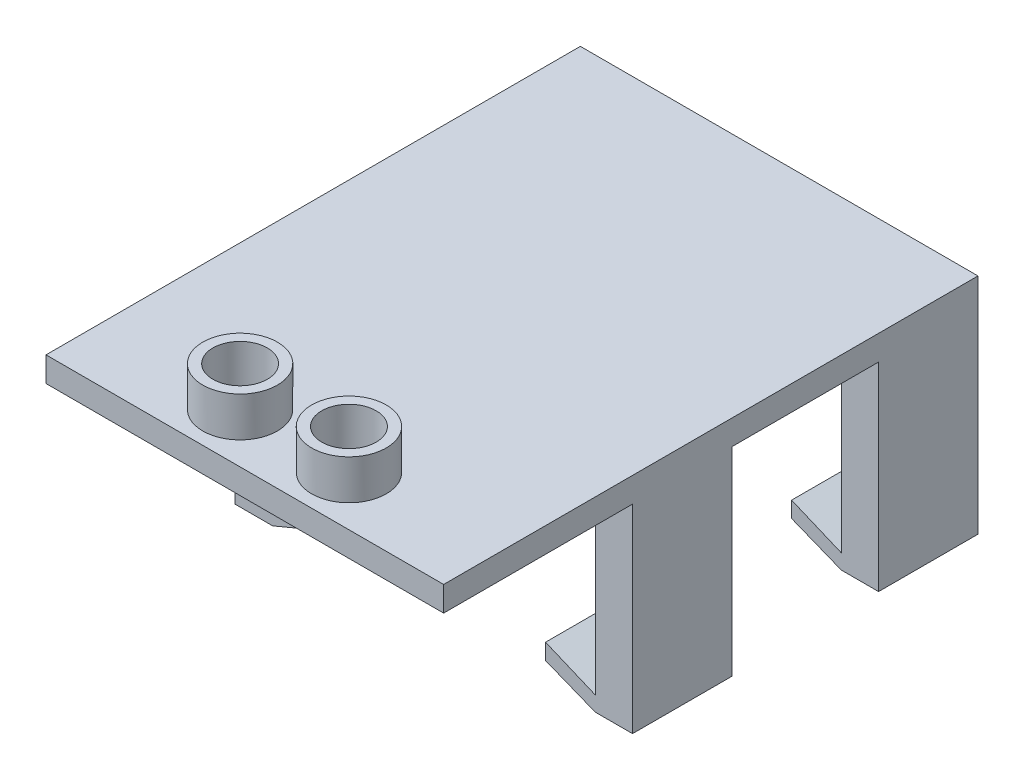
ISO-10303-21;
HEADER;
FILE_DESCRIPTION(('STEP AP214'),'2;1');
FILE_NAME('part.step','',(''),(''),'','','');
FILE_SCHEMA(('AUTOMOTIVE_DESIGN { 1 0 10303 214 1 1 1 1 }'));
ENDSEC;
DATA;
#1=APPLICATION_CONTEXT('core data for automotive mechanical design processes');
#2=APPLICATION_PROTOCOL_DEFINITION('international standard','automotive_design',2000,#1);
#3=PRODUCT_CONTEXT('',#1,'mechanical');
#4=PRODUCT('Part','Part','',(#3));
#5=PRODUCT_RELATED_PRODUCT_CATEGORY('part','',(#4));
#6=PRODUCT_DEFINITION_FORMATION('','',#4);
#7=PRODUCT_DEFINITION_CONTEXT('part definition',#1,'design');
#8=PRODUCT_DEFINITION('design','',#6,#7);
#9=PRODUCT_DEFINITION_SHAPE('','',#8);
#10=(LENGTH_UNIT() NAMED_UNIT(*) SI_UNIT(.MILLI.,.METRE.));
#11=(NAMED_UNIT(*) PLANE_ANGLE_UNIT() SI_UNIT($,.RADIAN.));
#12=(NAMED_UNIT(*) SI_UNIT($,.STERADIAN.) SOLID_ANGLE_UNIT());
#13=UNCERTAINTY_MEASURE_WITH_UNIT(LENGTH_MEASURE(1.E-05),#10,'distance_accuracy_value','');
#14=(GEOMETRIC_REPRESENTATION_CONTEXT(3) GLOBAL_UNCERTAINTY_ASSIGNED_CONTEXT((#13)) GLOBAL_UNIT_ASSIGNED_CONTEXT((#10,
#11,#12)) REPRESENTATION_CONTEXT('',''));
#15=CARTESIAN_POINT('',(0.,0.,0.));
#16=DIRECTION('',(0.,0.,1.));
#17=DIRECTION('',(1.,0.,0.));
#18=AXIS2_PLACEMENT_3D('',#15,#16,#17);
#19=CARTESIAN_POINT('',(0.,-20.32,0.));
#20=DIRECTION('',(0.,-1.,0.));
#21=DIRECTION('',(0.,0.,-1.));
#22=AXIS2_PLACEMENT_3D('',#19,#20,#21);
#23=PLANE('',#22);
#24=DIRECTION('',(1.,0.,0.));
#25=VECTOR('',#24,1.);
#26=CARTESIAN_POINT('',(-11.5172519083969,-20.32,-12.4409837837973));
#27=LINE('',#26,#25);
#28=CARTESIAN_POINT('',(-11.5172519083969,-20.32,-12.4409837837973));
#29=VERTEX_POINT('',#28);
#30=CARTESIAN_POINT('',(-7.66074574714831,-20.32,-12.4409837837973));
#31=VERTEX_POINT('',#30);
#32=EDGE_CURVE('E249',#29,#31,#27,.T.);
#33=ORIENTED_EDGE('',*,*,#32,.T.);
#34=DIRECTION('',(0.,0.,1.));
#35=VECTOR('',#34,1.);
#36=CARTESIAN_POINT('',(-7.66074574714831,-20.32,-12.4409837837973));
#37=LINE('',#36,#35);
#38=CARTESIAN_POINT('',(-7.66074574714831,-20.32,-2.28098378379731));
#39=VERTEX_POINT('',#38);
#40=EDGE_CURVE('E232',#31,#39,#37,.T.);
#41=ORIENTED_EDGE('',*,*,#40,.T.);
#42=DIRECTION('',(1.,0.,0.));
#43=VECTOR('',#42,1.);
#44=CARTESIAN_POINT('',(-11.517251908397,-20.32,-2.28098378379731));
#45=LINE('',#44,#43);
#46=CARTESIAN_POINT('',(-11.517251908397,-20.32,-2.28098378379731));
#47=VERTEX_POINT('',#46);
#48=EDGE_CURVE('E447',#47,#39,#45,.T.);
#49=ORIENTED_EDGE('',*,*,#48,.F.);
#50=DIRECTION('',(0.,0.,-1.));
#51=VECTOR('',#50,1.);
#52=CARTESIAN_POINT('',(-11.5172519083969,-20.32,27.9450162162027));
#53=LINE('',#52,#51);
#54=EDGE_CURVE('E255',#47,#29,#53,.T.);
#55=ORIENTED_EDGE('',*,*,#54,.T.);
#56=EDGE_LOOP('',(#33,#41,#49,#55));
#57=FACE_BOUND('',#56,.T.);
#58=ADVANCED_FACE('F37',(#57),#23,.T.);
#59=CARTESIAN_POINT('',(0.,-20.32,0.));
#60=DIRECTION('',(0.,1.,0.));
#61=DIRECTION('',(0.,0.,1.));
#62=AXIS2_PLACEMENT_3D('',#59,#60,#61);
#63=PLANE('',#62);
#64=DIRECTION('',(0.,0.,1.));
#65=VECTOR('',#64,1.);
#66=CARTESIAN_POINT('',(25.3127480916031,-20.32,-12.4409837837973));
#67=LINE('',#66,#65);
#68=CARTESIAN_POINT('',(25.3127480916031,-20.32,-12.4409837837973));
#69=VERTEX_POINT('',#68);
#70=CARTESIAN_POINT('',(25.3127480916031,-20.32,-2.28098378379732));
#71=VERTEX_POINT('',#70);
#72=EDGE_CURVE('E52',#69,#71,#67,.T.);
#73=ORIENTED_EDGE('',*,*,#72,.F.);
#74=DIRECTION('',(1.,0.,0.));
#75=VECTOR('',#74,1.);
#76=CARTESIAN_POINT('',(29.1227480916031,-20.32,-12.4409837837973));
#77=LINE('',#76,#75);
#78=CARTESIAN_POINT('',(29.1227480916031,-20.32,-12.4409837837973));
#79=VERTEX_POINT('',#78);
#80=EDGE_CURVE('E348',#69,#79,#77,.T.);
#81=ORIENTED_EDGE('',*,*,#80,.T.);
#82=DIRECTION('',(0.,0.,1.));
#83=VECTOR('',#82,1.);
#84=CARTESIAN_POINT('',(29.1227480916031,-20.32,27.9450162162027));
#85=LINE('',#84,#83);
#86=CARTESIAN_POINT('',(29.1227480916031,-20.32,-2.28098378379732));
#87=VERTEX_POINT('',#86);
#88=EDGE_CURVE('E339',#79,#87,#85,.T.);
#89=ORIENTED_EDGE('',*,*,#88,.T.);
#90=EDGE_CURVE('E457',#71,#87,#45,.T.);
#91=ORIENTED_EDGE('',*,*,#90,.F.);
#92=EDGE_LOOP('',(#73,#81,#89,#91));
#93=FACE_BOUND('',#92,.T.);
#94=ADVANCED_FACE('F517',(#93),#63,.F.);
#95=CARTESIAN_POINT('',(20.2327480916031,0.,0.));
#96=DIRECTION('',(-1.,0.,0.));
#97=DIRECTION('',(0.,0.,1.));
#98=AXIS2_PLACEMENT_3D('',#95,#96,#97);
#99=PLANE('',#98);
#100=DIRECTION('',(0.,-1.,0.));
#101=VECTOR('',#100,1.);
#102=CARTESIAN_POINT('',(20.2327480916031,-18.796,-12.4409837837973));
#103=LINE('',#102,#101);
#104=CARTESIAN_POINT('',(20.2327480916031,-16.6688197799885,-12.4409837837973));
#105=VERTEX_POINT('',#104);
#106=CARTESIAN_POINT('',(20.2327480916031,-18.2946026362876,-12.4409837837973));
#107=VERTEX_POINT('',#106);
#108=EDGE_CURVE('E361',#105,#107,#103,.T.);
#109=ORIENTED_EDGE('',*,*,#108,.T.);
#110=DIRECTION('',(0.,0.,1.));
#111=VECTOR('',#110,1.);
#112=CARTESIAN_POINT('',(20.2327480916031,-18.2946026362876,-12.4409837837973));
#113=LINE('',#112,#111);
#114=CARTESIAN_POINT('',(20.2327480916031,-18.2946026362876,-2.28098378379732));
#115=VERTEX_POINT('',#114);
#116=EDGE_CURVE('E476',#107,#115,#113,.T.);
#117=ORIENTED_EDGE('',*,*,#116,.T.);
#118=DIRECTION('',(0.,-1.,0.));
#119=VECTOR('',#118,1.);
#120=CARTESIAN_POINT('',(20.2327480916031,0.,-2.28098378379732));
#121=LINE('',#120,#119);
#122=CARTESIAN_POINT('',(20.2327480916031,-16.6688197799885,-2.28098378379732));
#123=VERTEX_POINT('',#122);
#124=EDGE_CURVE('E429',#123,#115,#121,.T.);
#125=ORIENTED_EDGE('',*,*,#124,.F.);
#126=DIRECTION('',(0.,0.,1.));
#127=VECTOR('',#126,1.);
#128=CARTESIAN_POINT('',(20.2327480916031,-16.6688197799885,-17.9796028196735));
#129=LINE('',#128,#127);
#130=EDGE_CURVE('E410',#105,#123,#129,.T.);
#131=ORIENTED_EDGE('',*,*,#130,.F.);
#132=EDGE_LOOP('',(#109,#117,#125,#131));
#133=FACE_BOUND('',#132,.T.);
#134=ADVANCED_FACE('F523',(#133),#99,.T.);
#135=CARTESIAN_POINT('',(-2.59340745083259,-16.6688197799885,-17.9796028196735));
#136=DIRECTION('',(0.999873452344455,-0.0159084661982284,0.));
#137=DIRECTION('',(0.0159084661982284,0.999873452344455,0.));
#138=AXIS2_PLACEMENT_3D('',#135,#136,#137);
#139=PLANE('',#138);
#140=DIRECTION('',(0.0159084661982284,0.999873452344455,0.));
#141=VECTOR('',#140,1.);
#142=CARTESIAN_POINT('',(-2.59340745083259,-16.6688197799885,-2.28098378379732));
#143=LINE('',#142,#141);
#144=CARTESIAN_POINT('',(-2.61803166417197,-18.2164923774667,-2.28098378379732));
#145=VERTEX_POINT('',#144);
#146=CARTESIAN_POINT('',(-2.59340745083259,-16.6688197799885,-2.28098378379731));
#147=VERTEX_POINT('',#146);
#148=EDGE_CURVE('E417',#145,#147,#143,.T.);
#149=ORIENTED_EDGE('',*,*,#148,.F.);
#150=DIRECTION('',(0.,0.,1.));
#151=VECTOR('',#150,1.);
#152=CARTESIAN_POINT('',(-2.61803166417197,-18.2164923774667,-12.4409837837973));
#153=LINE('',#152,#151);
#154=CARTESIAN_POINT('',(-2.61803166417197,-18.2164923774667,-12.4409837837973));
#155=VERTEX_POINT('',#154);
#156=EDGE_CURVE('E60',#155,#145,#153,.T.);
#157=ORIENTED_EDGE('',*,*,#156,.F.);
#158=DIRECTION('',(-0.0159084661982284,-0.999873452344455,0.));
#159=VECTOR('',#158,1.);
#160=CARTESIAN_POINT('',(-2.59340745083259,-16.6688197799885,-12.4409837837973));
#161=LINE('',#160,#159);
#162=CARTESIAN_POINT('',(-2.59340745083259,-16.6688197799885,-12.4409837837973));
#163=VERTEX_POINT('',#162);
#164=EDGE_CURVE('E251',#163,#155,#161,.T.);
#165=ORIENTED_EDGE('',*,*,#164,.F.);
#166=DIRECTION('',(0.,0.,1.));
#167=VECTOR('',#166,1.);
#168=CARTESIAN_POINT('',(-2.59340745083259,-16.6688197799885,-17.9796028196735));
#169=LINE('',#168,#167);
#170=EDGE_CURVE('E397',#163,#147,#169,.T.);
#171=ORIENTED_EDGE('',*,*,#170,.T.);
#172=EDGE_LOOP('',(#149,#157,#165,#171));
#173=FACE_BOUND('',#172,.T.);
#174=ADVANCED_FACE('F528',(#173),#139,.T.);
#175=DIRECTION('',(1.,0.,0.));
#176=VECTOR('',#175,1.);
#177=CARTESIAN_POINT('',(-11.517251908397,-20.32,12.7050162162027));
#178=LINE('',#177,#176);
#179=CARTESIAN_POINT('',(-11.517251908397,-20.32,12.7050162162027));
#180=VERTEX_POINT('',#179);
#181=CARTESIAN_POINT('',(-7.66074574714831,-20.32,12.7050162162027));
#182=VERTEX_POINT('',#181);
#183=EDGE_CURVE('E454',#180,#182,#178,.T.);
#184=ORIENTED_EDGE('',*,*,#183,.T.);
#185=CARTESIAN_POINT('',(-7.66074574714831,-20.32,22.8650162162027));
#186=VERTEX_POINT('',#185);
#187=EDGE_CURVE('E242',#182,#186,#37,.T.);
#188=ORIENTED_EDGE('',*,*,#187,.T.);
#189=DIRECTION('',(1.,0.,0.));
#190=VECTOR('',#189,1.);
#191=CARTESIAN_POINT('',(-11.5172519083969,-20.32,22.8650162162027));
#192=LINE('',#191,#190);
#193=CARTESIAN_POINT('',(-11.5172519083969,-20.32,22.8650162162027));
#194=VERTEX_POINT('',#193);
#195=EDGE_CURVE('E375',#194,#186,#192,.T.);
#196=ORIENTED_EDGE('',*,*,#195,.F.);
#197=EDGE_CURVE('E258',#194,#180,#53,.T.);
#198=ORIENTED_EDGE('',*,*,#197,.T.);
#199=EDGE_LOOP('',(#184,#188,#196,#198));
#200=FACE_BOUND('',#199,.T.);
#201=ADVANCED_FACE('F519',(#200),#23,.T.);
#202=CARTESIAN_POINT('',(25.3127480916031,-20.32,12.7050162162027));
#203=VERTEX_POINT('',#202);
#204=CARTESIAN_POINT('',(25.3127480916031,-20.32,22.8650162162027));
#205=VERTEX_POINT('',#204);
#206=EDGE_CURVE('E479',#203,#205,#67,.T.);
#207=ORIENTED_EDGE('',*,*,#206,.F.);
#208=CARTESIAN_POINT('',(29.1227480916031,-20.32,12.7050162162027));
#209=VERTEX_POINT('',#208);
#210=EDGE_CURVE('E453',#203,#209,#178,.T.);
#211=ORIENTED_EDGE('',*,*,#210,.T.);
#212=CARTESIAN_POINT('',(29.1227480916031,-20.32,22.8650162162027));
#213=VERTEX_POINT('',#212);
#214=EDGE_CURVE('E344',#209,#213,#85,.T.);
#215=ORIENTED_EDGE('',*,*,#214,.T.);
#216=EDGE_CURVE('E378',#205,#213,#192,.T.);
#217=ORIENTED_EDGE('',*,*,#216,.F.);
#218=EDGE_LOOP('',(#207,#211,#215,#217));
#219=FACE_BOUND('',#218,.T.);
#220=ADVANCED_FACE('F525',(#219),#63,.F.);
#221=DIRECTION('',(0.,1.,0.));
#222=VECTOR('',#221,1.);
#223=CARTESIAN_POINT('',(20.2327480916031,0.,12.7050162162027));
#224=LINE('',#223,#222);
#225=CARTESIAN_POINT('',(20.2327480916031,-18.2946026362876,12.7050162162027));
#226=VERTEX_POINT('',#225);
#227=CARTESIAN_POINT('',(20.2327480916031,-16.6688197799885,12.7050162162027));
#228=VERTEX_POINT('',#227);
#229=EDGE_CURVE('E445',#226,#228,#224,.T.);
#230=ORIENTED_EDGE('',*,*,#229,.F.);
#231=CARTESIAN_POINT('',(20.2327480916031,-18.2946026362876,22.8650162162027));
#232=VERTEX_POINT('',#231);
#233=EDGE_CURVE('E480',#226,#232,#113,.T.);
#234=ORIENTED_EDGE('',*,*,#233,.T.);
#235=DIRECTION('',(0.,1.,0.));
#236=VECTOR('',#235,1.);
#237=CARTESIAN_POINT('',(20.2327480916031,0.,22.8650162162027));
#238=LINE('',#237,#236);
#239=CARTESIAN_POINT('',(20.2327480916031,-16.6688197799885,22.8650162162027));
#240=VERTEX_POINT('',#239);
#241=EDGE_CURVE('E300',#232,#240,#238,.T.);
#242=ORIENTED_EDGE('',*,*,#241,.T.);
#243=EDGE_CURVE('E413',#228,#240,#129,.T.);
#244=ORIENTED_EDGE('',*,*,#243,.F.);
#245=EDGE_LOOP('',(#230,#234,#242,#244));
#246=FACE_BOUND('',#245,.T.);
#247=ADVANCED_FACE('F534',(#246),#99,.T.);
#248=CARTESIAN_POINT('',(-11.5172519083969,2.54,-12.4409837837973));
#249=DIRECTION('',(0.,0.,1.));
#250=DIRECTION('',(1.,0.,0.));
#251=AXIS2_PLACEMENT_3D('',#248,#249,#250);
#252=PLANE('',#251);
#253=DIRECTION('',(0.922922412237394,0.384986001031089,0.));
#254=VECTOR('',#253,1.);
#255=CARTESIAN_POINT('',(6.08451261866922,-14.5863305373994,-12.4409837837973));
#256=LINE('',#255,#254);
#257=EDGE_CURVE('E235',#31,#155,#256,.T.);
#258=ORIENTED_EDGE('',*,*,#257,.F.);
#259=ORIENTED_EDGE('',*,*,#32,.F.);
#260=DIRECTION('',(0.,-1.,0.));
#261=VECTOR('',#260,1.);
#262=CARTESIAN_POINT('',(-11.5172519083969,2.54,-12.4409837837973));
#263=LINE('',#262,#261);
#264=CARTESIAN_POINT('',(-11.5172519083969,2.54,-12.4409837837973));
#265=VERTEX_POINT('',#264);
#266=EDGE_CURVE('E283',#265,#29,#263,.T.);
#267=ORIENTED_EDGE('',*,*,#266,.F.);
#268=DIRECTION('',(-1.,0.,0.));
#269=VECTOR('',#268,1.);
#270=CARTESIAN_POINT('',(-11.5172519083969,2.54,-12.4409837837973));
#271=LINE('',#270,#269);
#272=CARTESIAN_POINT('',(29.1227480916031,2.54,-12.4409837837973));
#273=VERTEX_POINT('',#272);
#274=EDGE_CURVE('E281',#273,#265,#271,.T.);
#275=ORIENTED_EDGE('',*,*,#274,.F.);
#276=DIRECTION('',(0.,-1.,0.));
#277=VECTOR('',#276,1.);
#278=CARTESIAN_POINT('',(29.1227480916031,2.54,-12.4409837837973));
#279=LINE('',#278,#277);
#280=EDGE_CURVE('E291',#273,#79,#279,.T.);
#281=ORIENTED_EDGE('',*,*,#280,.T.);
#282=ORIENTED_EDGE('',*,*,#80,.F.);
#283=DIRECTION('',(0.928892421611158,-0.370349657855058,0.));
#284=VECTOR('',#283,1.);
#285=CARTESIAN_POINT('',(-3.51851670614279,-8.82496698546269,-12.4409837837973));
#286=LINE('',#285,#284);
#287=EDGE_CURVE('E485',#107,#69,#286,.T.);
#288=ORIENTED_EDGE('',*,*,#287,.F.);
#289=ORIENTED_EDGE('',*,*,#108,.F.);
#290=DIRECTION('',(0.922397741391246,-0.386241383950928,0.));
#291=VECTOR('',#290,1.);
#292=CARTESIAN_POINT('',(20.2327480916031,-16.6688197799885,-12.4409837837973));
#293=LINE('',#292,#291);
#294=CARTESIAN_POINT('',(25.3127480916031,-18.796,-12.4409837837973));
#295=VERTEX_POINT('',#294);
#296=EDGE_CURVE('E414',#105,#295,#293,.T.);
#297=ORIENTED_EDGE('',*,*,#296,.T.);
#298=DIRECTION('',(0.,1.,0.));
#299=VECTOR('',#298,1.);
#300=CARTESIAN_POINT('',(25.3127480916031,-20.32,-12.4409837837973));
#301=LINE('',#300,#299);
#302=CARTESIAN_POINT('',(25.3127480916031,-2.9718,-12.4409837837973));
#303=VERTEX_POINT('',#302);
#304=EDGE_CURVE('E351',#295,#303,#301,.T.);
#305=ORIENTED_EDGE('',*,*,#304,.T.);
#306=DIRECTION('',(1.,0.,0.));
#307=VECTOR('',#306,1.);
#308=CARTESIAN_POINT('',(-11.5172519083969,-2.9718,-12.4409837837973));
#309=LINE('',#308,#307);
#310=CARTESIAN_POINT('',(-7.70725190839694,-2.9718,-12.4409837837973));
#311=VERTEX_POINT('',#310);
#312=EDGE_CURVE('E392',#311,#303,#309,.T.);
#313=ORIENTED_EDGE('',*,*,#312,.F.);
#314=DIRECTION('',(0.,1.,0.));
#315=VECTOR('',#314,1.);
#316=CARTESIAN_POINT('',(-7.70725190839694,-20.32,-12.4409837837973));
#317=LINE('',#316,#315);
#318=CARTESIAN_POINT('',(-7.70725190839694,-18.796,-12.4409837837973));
#319=VERTEX_POINT('',#318);
#320=EDGE_CURVE('E257',#319,#311,#317,.T.);
#321=ORIENTED_EDGE('',*,*,#320,.F.);
#322=DIRECTION('',(0.923306770954936,0.384063284770582,0.));
#323=VECTOR('',#322,1.);
#324=CARTESIAN_POINT('',(-7.70725190839694,-18.796,-12.4409837837973));
#325=LINE('',#324,#323);
#326=EDGE_CURVE('E396',#319,#163,#325,.T.);
#327=ORIENTED_EDGE('',*,*,#326,.T.);
#328=ORIENTED_EDGE('',*,*,#164,.T.);
#329=EDGE_LOOP('',(#258,#259,#267,#275,#281,#282,#288,#289,#297,#305,#313,#321,#327,#328));
#330=FACE_BOUND('',#329,.T.);
#331=ADVANCED_FACE('F247',(#330),#252,.F.);
#332=CARTESIAN_POINT('',(0.,0.,22.8650162162027));
#333=DIRECTION('',(0.,0.,1.));
#334=DIRECTION('',(1.,0.,0.));
#335=AXIS2_PLACEMENT_3D('',#332,#333,#334);
#336=PLANE('',#335);
#337=ORIENTED_EDGE('',*,*,#195,.T.);
#338=DIRECTION('',(0.922922412237394,0.384986001031089,0.));
#339=VECTOR('',#338,1.);
#340=CARTESIAN_POINT('',(6.08451261866922,-14.5863305373994,22.8650162162027));
#341=LINE('',#340,#339);
#342=CARTESIAN_POINT('',(-2.61803166417197,-18.2164923774667,22.8650162162027));
#343=VERTEX_POINT('',#342);
#344=EDGE_CURVE('E252',#186,#343,#341,.T.);
#345=ORIENTED_EDGE('',*,*,#344,.T.);
#346=DIRECTION('',(0.0159084661982284,0.999873452344455,0.));
#347=VECTOR('',#346,1.);
#348=CARTESIAN_POINT('',(-2.59340745083259,-16.6688197799885,22.8650162162027));
#349=LINE('',#348,#347);
#350=CARTESIAN_POINT('',(-2.59340745083259,-16.6688197799885,22.8650162162027));
#351=VERTEX_POINT('',#350);
#352=EDGE_CURVE('E404',#343,#351,#349,.T.);
#353=ORIENTED_EDGE('',*,*,#352,.T.);
#354=DIRECTION('',(-0.923306770954936,-0.384063284770582,0.));
#355=VECTOR('',#354,1.);
#356=CARTESIAN_POINT('',(-7.70725190839694,-18.796,22.8650162162027));
#357=LINE('',#356,#355);
#358=CARTESIAN_POINT('',(-7.70725190839694,-18.796,22.8650162162027));
#359=VERTEX_POINT('',#358);
#360=EDGE_CURVE('E401',#351,#359,#357,.T.);
#361=ORIENTED_EDGE('',*,*,#360,.T.);
#362=DIRECTION('',(0.,1.,0.));
#363=VECTOR('',#362,1.);
#364=CARTESIAN_POINT('',(-7.70725190839694,-20.32,22.8650162162027));
#365=LINE('',#364,#363);
#366=CARTESIAN_POINT('',(-7.70725190839694,-2.9718,22.8650162162027));
#367=VERTEX_POINT('',#366);
#368=EDGE_CURVE('E365',#359,#367,#365,.T.);
#369=ORIENTED_EDGE('',*,*,#368,.T.);
#370=DIRECTION('',(-1.,0.,0.));
#371=VECTOR('',#370,1.);
#372=CARTESIAN_POINT('',(-11.5172519083969,-2.9718,22.8650162162027));
#373=LINE('',#372,#371);
#374=CARTESIAN_POINT('',(25.3127480916031,-2.9718,22.8650162162027));
#375=VERTEX_POINT('',#374);
#376=EDGE_CURVE('E389',#375,#367,#373,.T.);
#377=ORIENTED_EDGE('',*,*,#376,.F.);
#378=DIRECTION('',(0.,-1.,0.));
#379=VECTOR('',#378,1.);
#380=CARTESIAN_POINT('',(25.3127480916031,-20.32,22.8650162162027));
#381=LINE('',#380,#379);
#382=CARTESIAN_POINT('',(25.3127480916031,-18.796,22.8650162162027));
#383=VERTEX_POINT('',#382);
#384=EDGE_CURVE('E368',#375,#383,#381,.T.);
#385=ORIENTED_EDGE('',*,*,#384,.T.);
#386=DIRECTION('',(-0.922397741391246,0.386241383950928,0.));
#387=VECTOR('',#386,1.);
#388=CARTESIAN_POINT('',(20.2327480916031,-16.6688197799885,22.8650162162027));
#389=LINE('',#388,#387);
#390=EDGE_CURVE('E406',#383,#240,#389,.T.);
#391=ORIENTED_EDGE('',*,*,#390,.T.);
#392=ORIENTED_EDGE('',*,*,#241,.F.);
#393=DIRECTION('',(0.928892421611158,-0.370349657855058,0.));
#394=VECTOR('',#393,1.);
#395=CARTESIAN_POINT('',(-3.51851670614279,-8.82496698546269,22.8650162162027));
#396=LINE('',#395,#394);
#397=EDGE_CURVE('E482',#232,#205,#396,.T.);
#398=ORIENTED_EDGE('',*,*,#397,.T.);
#399=ORIENTED_EDGE('',*,*,#216,.T.);
#400=DIRECTION('',(0.,1.,0.));
#401=VECTOR('',#400,1.);
#402=CARTESIAN_POINT('',(29.1227480916031,0.,22.8650162162027));
#403=LINE('',#402,#401);
#404=CARTESIAN_POINT('',(29.1227480916031,0.,22.8650162162027));
#405=VERTEX_POINT('',#404);
#406=EDGE_CURVE('E373',#213,#405,#403,.T.);
#407=ORIENTED_EDGE('',*,*,#406,.T.);
#408=DIRECTION('',(-1.,0.,0.));
#409=VECTOR('',#408,1.);
#410=CARTESIAN_POINT('',(-11.5172519083969,0.,22.8650162162027));
#411=LINE('',#410,#409);
#412=CARTESIAN_POINT('',(-11.5172519083969,0.,22.8650162162027));
#413=VERTEX_POINT('',#412);
#414=EDGE_CURVE('E371',#405,#413,#411,.T.);
#415=ORIENTED_EDGE('',*,*,#414,.T.);
#416=DIRECTION('',(0.,-1.,0.));
#417=VECTOR('',#416,1.);
#418=CARTESIAN_POINT('',(-11.5172519083969,0.,22.8650162162027));
#419=LINE('',#418,#417);
#420=EDGE_CURVE('E379',#413,#194,#419,.T.);
#421=ORIENTED_EDGE('',*,*,#420,.T.);
#422=EDGE_LOOP('',(#337,#345,#353,#361,#369,#377,#385,#391,#392,#398,#399,#407,#415,#421));
#423=FACE_BOUND('',#422,.T.);
#424=ADVANCED_FACE('F561',(#423),#336,.T.);
#425=ORIENTED_EDGE('',*,*,#352,.F.);
#426=CARTESIAN_POINT('',(-2.61803166417197,-18.2164923774667,12.7050162162027));
#427=VERTEX_POINT('',#426);
#428=EDGE_CURVE('E241',#427,#343,#153,.T.);
#429=ORIENTED_EDGE('',*,*,#428,.F.);
#430=DIRECTION('',(-0.0159084661982284,-0.999873452344455,0.));
#431=VECTOR('',#430,1.);
#432=CARTESIAN_POINT('',(-2.59340745083259,-16.6688197799885,12.7050162162027));
#433=LINE('',#432,#431);
#434=CARTESIAN_POINT('',(-2.59340745083259,-16.6688197799885,12.7050162162027));
#435=VERTEX_POINT('',#434);
#436=EDGE_CURVE('E432',#435,#427,#433,.T.);
#437=ORIENTED_EDGE('',*,*,#436,.F.);
#438=EDGE_CURVE('E400',#435,#351,#169,.T.);
#439=ORIENTED_EDGE('',*,*,#438,.T.);
#440=EDGE_LOOP('',(#425,#429,#437,#439));
#441=FACE_BOUND('',#440,.T.);
#442=ADVANCED_FACE('F538',(#441),#139,.T.);
#443=CARTESIAN_POINT('',(-11.517251908397,-20.32,-2.28098378379731));
#444=DIRECTION('',(0.,0.,-1.));
#445=DIRECTION('',(-1.,0.,0.));
#446=AXIS2_PLACEMENT_3D('',#443,#444,#445);
#447=PLANE('',#446);
#448=DIRECTION('',(-0.922922412237394,-0.384986001031089,0.));
#449=VECTOR('',#448,1.);
#450=CARTESIAN_POINT('',(-10.9456628519647,-21.6902637222083,-2.28098378379731));
#451=LINE('',#450,#449);
#452=EDGE_CURVE('E236',#145,#39,#451,.T.);
#453=ORIENTED_EDGE('',*,*,#452,.F.);
#454=ORIENTED_EDGE('',*,*,#148,.T.);
#455=DIRECTION('',(-0.923306770954936,-0.384063284770582,0.));
#456=VECTOR('',#455,1.);
#457=CARTESIAN_POINT('',(-7.70725190839694,-18.796,-2.28098378379731));
#458=LINE('',#457,#456);
#459=CARTESIAN_POINT('',(-7.70725190839694,-18.796,-2.28098378379731));
#460=VERTEX_POINT('',#459);
#461=EDGE_CURVE('E419',#147,#460,#458,.T.);
#462=ORIENTED_EDGE('',*,*,#461,.T.);
#463=DIRECTION('',(0.,-1.,0.));
#464=VECTOR('',#463,1.);
#465=CARTESIAN_POINT('',(-7.70725190839694,-20.32,-2.28098378379731));
#466=LINE('',#465,#464);
#467=CARTESIAN_POINT('',(-7.70725190839694,-2.9718,-2.28098378379732));
#468=VERTEX_POINT('',#467);
#469=EDGE_CURVE('E421',#468,#460,#466,.T.);
#470=ORIENTED_EDGE('',*,*,#469,.F.);
#471=DIRECTION('',(1.,0.,0.));
#472=VECTOR('',#471,1.);
#473=CARTESIAN_POINT('',(0.,-2.9718,-2.28098378379732));
#474=LINE('',#473,#472);
#475=CARTESIAN_POINT('',(25.3127480916031,-2.9718,-2.28098378379732));
#476=VERTEX_POINT('',#475);
#477=EDGE_CURVE('E424',#468,#476,#474,.T.);
#478=ORIENTED_EDGE('',*,*,#477,.T.);
#479=DIRECTION('',(0.,1.,0.));
#480=VECTOR('',#479,1.);
#481=CARTESIAN_POINT('',(25.3127480916031,-20.32,-2.28098378379732));
#482=LINE('',#481,#480);
#483=CARTESIAN_POINT('',(25.3127480916031,-18.796,-2.28098378379732));
#484=VERTEX_POINT('',#483);
#485=EDGE_CURVE('E426',#484,#476,#482,.T.);
#486=ORIENTED_EDGE('',*,*,#485,.F.);
#487=DIRECTION('',(-0.922397741391246,0.386241383950928,0.));
#488=VECTOR('',#487,1.);
#489=CARTESIAN_POINT('',(20.2327480916031,-16.6688197799885,-2.28098378379732));
#490=LINE('',#489,#488);
#491=EDGE_CURVE('E304',#484,#123,#490,.T.);
#492=ORIENTED_EDGE('',*,*,#491,.T.);
#493=ORIENTED_EDGE('',*,*,#124,.T.);
#494=DIRECTION('',(-0.928892421611158,0.370349657855058,0.));
#495=VECTOR('',#494,1.);
#496=CARTESIAN_POINT('',(-6.46569076042514,-7.64992789885931,-2.28098378379732));
#497=LINE('',#496,#495);
#498=EDGE_CURVE('E474',#71,#115,#497,.T.);
#499=ORIENTED_EDGE('',*,*,#498,.F.);
#500=ORIENTED_EDGE('',*,*,#90,.T.);
#501=DIRECTION('',(0.,1.,0.));
#502=VECTOR('',#501,1.);
#503=CARTESIAN_POINT('',(29.1227480916031,-20.32,-2.28098378379732));
#504=LINE('',#503,#502);
#505=CARTESIAN_POINT('',(29.1227480916031,0.,-2.28098378379732));
#506=VERTEX_POINT('',#505);
#507=EDGE_CURVE('E465',#87,#506,#504,.T.);
#508=ORIENTED_EDGE('',*,*,#507,.T.);
#509=DIRECTION('',(1.,0.,0.));
#510=VECTOR('',#509,1.);
#511=CARTESIAN_POINT('',(-11.517251908397,0.,-2.28098378379732));
#512=LINE('',#511,#510);
#513=CARTESIAN_POINT('',(-11.517251908397,0.,-2.28098378379732));
#514=VERTEX_POINT('',#513);
#515=EDGE_CURVE('E448',#514,#506,#512,.T.);
#516=ORIENTED_EDGE('',*,*,#515,.F.);
#517=DIRECTION('',(0.,1.,0.));
#518=VECTOR('',#517,1.);
#519=CARTESIAN_POINT('',(-11.517251908397,-20.32,-2.28098378379731));
#520=LINE('',#519,#518);
#521=EDGE_CURVE('E343',#47,#514,#520,.T.);
#522=ORIENTED_EDGE('',*,*,#521,.F.);
#523=ORIENTED_EDGE('',*,*,#48,.T.);
#524=EDGE_LOOP('',(#453,#454,#462,#470,#478,#486,#492,#493,#499,#500,#508,#516,#522,#523));
#525=FACE_BOUND('',#524,.T.);
#526=ADVANCED_FACE('F691',(#525),#447,.F.);
#527=CARTESIAN_POINT('',(-11.517251908397,-20.32,12.7050162162027));
#528=DIRECTION('',(0.,0.,1.));
#529=DIRECTION('',(0.,-1.,0.));
#530=AXIS2_PLACEMENT_3D('',#527,#528,#529);
#531=PLANE('',#530);
#532=DIRECTION('',(0.922922412237394,0.384986001031089,0.));
#533=VECTOR('',#532,1.);
#534=CARTESIAN_POINT('',(-10.9456628519647,-21.6902637222083,12.7050162162027));
#535=LINE('',#534,#533);
#536=EDGE_CURVE('E308',#182,#427,#535,.T.);
#537=ORIENTED_EDGE('',*,*,#536,.F.);
#538=ORIENTED_EDGE('',*,*,#183,.F.);
#539=DIRECTION('',(0.,-1.,0.));
#540=VECTOR('',#539,1.);
#541=CARTESIAN_POINT('',(-11.517251908397,-20.32,12.7050162162027));
#542=LINE('',#541,#540);
#543=CARTESIAN_POINT('',(-11.517251908397,0.,12.7050162162027));
#544=VERTEX_POINT('',#543);
#545=EDGE_CURVE('E451',#544,#180,#542,.T.);
#546=ORIENTED_EDGE('',*,*,#545,.F.);
#547=DIRECTION('',(1.,0.,0.));
#548=VECTOR('',#547,1.);
#549=CARTESIAN_POINT('',(-11.517251908397,0.,12.7050162162027));
#550=LINE('',#549,#548);
#551=CARTESIAN_POINT('',(29.1227480916031,0.,12.7050162162027));
#552=VERTEX_POINT('',#551);
#553=EDGE_CURVE('E450',#544,#552,#550,.T.);
#554=ORIENTED_EDGE('',*,*,#553,.T.);
#555=DIRECTION('',(0.,-1.,0.));
#556=VECTOR('',#555,1.);
#557=CARTESIAN_POINT('',(29.1227480916031,-20.32,12.7050162162027));
#558=LINE('',#557,#556);
#559=EDGE_CURVE('E459',#552,#209,#558,.T.);
#560=ORIENTED_EDGE('',*,*,#559,.T.);
#561=ORIENTED_EDGE('',*,*,#210,.F.);
#562=DIRECTION('',(0.928892421611158,-0.370349657855058,0.));
#563=VECTOR('',#562,1.);
#564=CARTESIAN_POINT('',(-6.46569076042514,-7.64992789885931,12.7050162162027));
#565=LINE('',#564,#563);
#566=EDGE_CURVE('E306',#226,#203,#565,.T.);
#567=ORIENTED_EDGE('',*,*,#566,.F.);
#568=ORIENTED_EDGE('',*,*,#229,.T.);
#569=DIRECTION('',(0.922397741391246,-0.386241383950928,0.));
#570=VECTOR('',#569,1.);
#571=CARTESIAN_POINT('',(20.2327480916031,-16.6688197799885,12.7050162162027));
#572=LINE('',#571,#570);
#573=CARTESIAN_POINT('',(25.3127480916031,-18.796,12.7050162162027));
#574=VERTEX_POINT('',#573);
#575=EDGE_CURVE('E302',#228,#574,#572,.T.);
#576=ORIENTED_EDGE('',*,*,#575,.T.);
#577=DIRECTION('',(0.,-1.,0.));
#578=VECTOR('',#577,1.);
#579=CARTESIAN_POINT('',(25.3127480916031,-20.32,12.7050162162027));
#580=LINE('',#579,#578);
#581=CARTESIAN_POINT('',(25.3127480916031,-2.9718,12.7050162162027));
#582=VERTEX_POINT('',#581);
#583=EDGE_CURVE('E442',#582,#574,#580,.T.);
#584=ORIENTED_EDGE('',*,*,#583,.F.);
#585=DIRECTION('',(-1.,0.,0.));
#586=VECTOR('',#585,1.);
#587=CARTESIAN_POINT('',(0.,-2.9718,12.7050162162027));
#588=LINE('',#587,#586);
#589=CARTESIAN_POINT('',(-7.70725190839694,-2.9718,12.7050162162027));
#590=VERTEX_POINT('',#589);
#591=EDGE_CURVE('E440',#582,#590,#588,.T.);
#592=ORIENTED_EDGE('',*,*,#591,.T.);
#593=DIRECTION('',(0.,1.,0.));
#594=VECTOR('',#593,1.);
#595=CARTESIAN_POINT('',(-7.70725190839694,-20.32,12.7050162162027));
#596=LINE('',#595,#594);
#597=CARTESIAN_POINT('',(-7.70725190839694,-18.796,12.7050162162027));
#598=VERTEX_POINT('',#597);
#599=EDGE_CURVE('E437',#598,#590,#596,.T.);
#600=ORIENTED_EDGE('',*,*,#599,.F.);
#601=DIRECTION('',(0.923306770954936,0.384063284770582,0.));
#602=VECTOR('',#601,1.);
#603=CARTESIAN_POINT('',(-7.70725190839694,-18.796,12.7050162162027));
#604=LINE('',#603,#602);
#605=EDGE_CURVE('E435',#598,#435,#604,.T.);
#606=ORIENTED_EDGE('',*,*,#605,.T.);
#607=ORIENTED_EDGE('',*,*,#436,.T.);
#608=EDGE_LOOP('',(#537,#538,#546,#554,#560,#561,#567,#568,#576,#584,#592,#600,#606,#607));
#609=FACE_BOUND('',#608,.T.);
#610=ADVANCED_FACE('F545',(#609),#531,.F.);
#611=CARTESIAN_POINT('',(25.3127480916031,-20.32,27.9450162162027));
#612=DIRECTION('',(1.,0.,0.));
#613=DIRECTION('',(0.,0.,-1.));
#614=AXIS2_PLACEMENT_3D('',#611,#612,#613);
#615=PLANE('',#614);
#616=DIRECTION('',(0.,0.,-1.));
#617=VECTOR('',#616,1.);
#618=CARTESIAN_POINT('',(25.3127480916031,-18.796,-12.4409837837973));
#619=LINE('',#618,#617);
#620=EDGE_CURVE('E362',#484,#295,#619,.T.);
#621=ORIENTED_EDGE('',*,*,#620,.F.);
#622=ORIENTED_EDGE('',*,*,#485,.T.);
#623=DIRECTION('',(0.,0.,-1.));
#624=VECTOR('',#623,1.);
#625=CARTESIAN_POINT('',(25.3127480916031,-2.9718,27.9450162162027));
#626=LINE('',#625,#624);
#627=EDGE_CURVE('E384',#476,#303,#626,.T.);
#628=ORIENTED_EDGE('',*,*,#627,.T.);
#629=ORIENTED_EDGE('',*,*,#304,.F.);
#630=EDGE_LOOP('',(#621,#622,#628,#629));
#631=FACE_BOUND('',#630,.T.);
#632=ADVANCED_FACE('F647',(#631),#615,.F.);
#633=CARTESIAN_POINT('',(-7.70725190839694,-20.32,27.9450162162027));
#634=DIRECTION('',(-1.,0.,0.));
#635=DIRECTION('',(0.,0.,1.));
#636=AXIS2_PLACEMENT_3D('',#633,#634,#635);
#637=PLANE('',#636);
#638=DIRECTION('',(0.,0.,1.));
#639=VECTOR('',#638,1.);
#640=CARTESIAN_POINT('',(-7.70725190839694,-2.9718,27.9450162162027));
#641=LINE('',#640,#639);
#642=EDGE_CURVE('E385',#311,#468,#641,.T.);
#643=ORIENTED_EDGE('',*,*,#642,.T.);
#644=ORIENTED_EDGE('',*,*,#469,.T.);
#645=DIRECTION('',(0.,0.,1.));
#646=VECTOR('',#645,1.);
#647=CARTESIAN_POINT('',(-7.70725190839694,-18.796,27.9450162162027));
#648=LINE('',#647,#646);
#649=EDGE_CURVE('E354',#319,#460,#648,.T.);
#650=ORIENTED_EDGE('',*,*,#649,.F.);
#651=ORIENTED_EDGE('',*,*,#320,.T.);
#652=EDGE_LOOP('',(#643,#644,#650,#651));
#653=FACE_BOUND('',#652,.T.);
#654=ADVANCED_FACE('F641',(#653),#637,.F.);
#655=CARTESIAN_POINT('',(0.,-2.9718,0.));
#656=DIRECTION('',(0.,-1.,0.));
#657=DIRECTION('',(0.,0.,-1.));
#658=AXIS2_PLACEMENT_3D('',#655,#656,#657);
#659=PLANE('',#658);
#660=ORIENTED_EDGE('',*,*,#477,.F.);
#661=ORIENTED_EDGE('',*,*,#642,.F.);
#662=ORIENTED_EDGE('',*,*,#312,.T.);
#663=ORIENTED_EDGE('',*,*,#627,.F.);
#664=EDGE_LOOP('',(#660,#661,#662,#663));
#665=FACE_BOUND('',#664,.T.);
#666=ADVANCED_FACE('F615',(#665),#659,.T.);
#667=CARTESIAN_POINT('',(-7.70725190839694,-18.796,-17.9796028196735));
#668=DIRECTION('',(-0.384063284770582,0.923306770954936,0.));
#669=DIRECTION('',(-0.923306770954936,-0.384063284770582,0.));
#670=AXIS2_PLACEMENT_3D('',#667,#668,#669);
#671=PLANE('',#670);
#672=ORIENTED_EDGE('',*,*,#461,.F.);
#673=ORIENTED_EDGE('',*,*,#170,.F.);
#674=ORIENTED_EDGE('',*,*,#326,.F.);
#675=ORIENTED_EDGE('',*,*,#649,.T.);
#676=EDGE_LOOP('',(#672,#673,#674,#675));
#677=FACE_BOUND('',#676,.T.);
#678=ADVANCED_FACE('F658',(#677),#671,.T.);
#679=CARTESIAN_POINT('',(20.2327480916031,-16.6688197799885,-17.9796028196735));
#680=DIRECTION('',(0.386241383950928,0.922397741391246,0.));
#681=DIRECTION('',(-0.922397741391246,0.386241383950928,0.));
#682=AXIS2_PLACEMENT_3D('',#679,#680,#681);
#683=PLANE('',#682);
#684=ORIENTED_EDGE('',*,*,#491,.F.);
#685=ORIENTED_EDGE('',*,*,#620,.T.);
#686=ORIENTED_EDGE('',*,*,#296,.F.);
#687=ORIENTED_EDGE('',*,*,#130,.T.);
#688=EDGE_LOOP('',(#684,#685,#686,#687));
#689=FACE_BOUND('',#688,.T.);
#690=ADVANCED_FACE('F598',(#689),#683,.T.);
#691=CARTESIAN_POINT('',(0.,0.,0.));
#692=DIRECTION('',(0.,1.,0.));
#693=DIRECTION('',(0.,0.,1.));
#694=AXIS2_PLACEMENT_3D('',#691,#692,#693);
#695=PLANE('',#694);
#696=DIRECTION('',(0.,0.,1.));
#697=VECTOR('',#696,1.);
#698=CARTESIAN_POINT('',(-11.5172519083969,0.,-12.4409837837973));
#699=LINE('',#698,#697);
#700=CARTESIAN_POINT('',(-11.5172519083969,0.,42.1690162162027));
#701=VERTEX_POINT('',#700);
#702=EDGE_CURVE('E272',#413,#701,#699,.T.);
#703=ORIENTED_EDGE('',*,*,#702,.F.);
#704=ORIENTED_EDGE('',*,*,#414,.F.);
#705=DIRECTION('',(0.,0.,-1.));
#706=VECTOR('',#705,1.);
#707=CARTESIAN_POINT('',(29.1227480916031,0.,-12.4409837837973));
#708=LINE('',#707,#706);
#709=CARTESIAN_POINT('',(29.1227480916031,0.,42.1690162162027));
#710=VERTEX_POINT('',#709);
#711=EDGE_CURVE('E277',#710,#405,#708,.T.);
#712=ORIENTED_EDGE('',*,*,#711,.F.);
#713=DIRECTION('',(1.,0.,0.));
#714=VECTOR('',#713,1.);
#715=CARTESIAN_POINT('',(18.8852561135843,0.,42.1690162162027));
#716=LINE('',#715,#714);
#717=EDGE_CURVE('E285',#701,#710,#716,.T.);
#718=ORIENTED_EDGE('',*,*,#717,.F.);
#719=EDGE_LOOP('',(#703,#704,#712,#718));
#720=FACE_BOUND('',#719,.T.);
#721=CARTESIAN_POINT('',(3.24014809160307,0.,37.0890162162027));
#722=DIRECTION('',(0.,1.,0.));
#723=DIRECTION('',(0.,0.,1.));
#724=AXIS2_PLACEMENT_3D('',#721,#722,#723);
#725=CIRCLE('',#724,2.7813);
#726=CARTESIAN_POINT('',(3.24014809160307,0.,39.8703162162027));
#727=VERTEX_POINT('',#726);
#728=EDGE_CURVE('E269',#727,#727,#725,.T.);
#729=ORIENTED_EDGE('',*,*,#728,.T.);
#730=EDGE_LOOP('',(#729));
#731=FACE_BOUND('',#730,.T.);
#732=CARTESIAN_POINT('',(14.3653480916031,0.,37.0890162162027));
#733=DIRECTION('',(0.,1.,0.));
#734=DIRECTION('',(0.,0.,1.));
#735=AXIS2_PLACEMENT_3D('',#732,#733,#734);
#736=CIRCLE('',#735,2.7813);
#737=CARTESIAN_POINT('',(14.3653480916031,0.,39.8703162162027));
#738=VERTEX_POINT('',#737);
#739=EDGE_CURVE('E261',#738,#738,#736,.T.);
#740=ORIENTED_EDGE('',*,*,#739,.T.);
#741=EDGE_LOOP('',(#740));
#742=FACE_BOUND('',#741,.T.);
#743=ADVANCED_FACE('F595',(#720,#731,#742),#695,.F.);
#744=EDGE_CURVE('E381',#375,#582,#626,.T.);
#745=ORIENTED_EDGE('',*,*,#744,.T.);
#746=ORIENTED_EDGE('',*,*,#583,.T.);
#747=EDGE_CURVE('E358',#383,#574,#619,.T.);
#748=ORIENTED_EDGE('',*,*,#747,.F.);
#749=ORIENTED_EDGE('',*,*,#384,.F.);
#750=EDGE_LOOP('',(#745,#746,#748,#749));
#751=FACE_BOUND('',#750,.T.);
#752=ADVANCED_FACE('F572',(#751),#615,.F.);
#753=EDGE_CURVE('E357',#598,#359,#648,.T.);
#754=ORIENTED_EDGE('',*,*,#753,.F.);
#755=ORIENTED_EDGE('',*,*,#599,.T.);
#756=EDGE_CURVE('E388',#590,#367,#641,.T.);
#757=ORIENTED_EDGE('',*,*,#756,.T.);
#758=ORIENTED_EDGE('',*,*,#368,.F.);
#759=EDGE_LOOP('',(#754,#755,#757,#758));
#760=FACE_BOUND('',#759,.T.);
#761=ADVANCED_FACE('F318',(#760),#637,.F.);
#762=CARTESIAN_POINT('',(0.,2.54,0.));
#763=DIRECTION('',(0.,1.,0.));
#764=DIRECTION('',(0.,0.,1.));
#765=AXIS2_PLACEMENT_3D('',#762,#763,#764);
#766=PLANE('',#765);
#767=CARTESIAN_POINT('',(14.3653480916031,2.54,37.0890162162027));
#768=DIRECTION('',(0.,1.,0.));
#769=DIRECTION('',(0.,0.,1.));
#770=AXIS2_PLACEMENT_3D('',#767,#768,#769);
#771=CIRCLE('',#770,3.81);
#772=CARTESIAN_POINT('',(14.3653480916031,2.54,40.8990162162027));
#773=VERTEX_POINT('',#772);
#774=EDGE_CURVE('E11',#773,#773,#771,.T.);
#775=ORIENTED_EDGE('',*,*,#774,.F.);
#776=EDGE_LOOP('',(#775));
#777=FACE_BOUND('',#776,.T.);
#778=CARTESIAN_POINT('',(3.24014809160307,2.54,37.0890162162027));
#779=DIRECTION('',(0.,1.,0.));
#780=DIRECTION('',(0.,0.,1.));
#781=AXIS2_PLACEMENT_3D('',#778,#779,#780);
#782=CIRCLE('',#781,3.81);
#783=CARTESIAN_POINT('',(3.24014809160307,2.54,40.8990162162027));
#784=VERTEX_POINT('',#783);
#785=EDGE_CURVE('E45',#784,#784,#782,.T.);
#786=ORIENTED_EDGE('',*,*,#785,.F.);
#787=EDGE_LOOP('',(#786));
#788=FACE_BOUND('',#787,.T.);
#789=DIRECTION('',(0.,0.,1.));
#790=VECTOR('',#789,1.);
#791=CARTESIAN_POINT('',(-11.5172519083969,2.54,-12.4409837837973));
#792=LINE('',#791,#790);
#793=CARTESIAN_POINT('',(-11.5172519083969,2.54,42.1690162162027));
#794=VERTEX_POINT('',#793);
#795=EDGE_CURVE('E273',#265,#794,#792,.T.);
#796=ORIENTED_EDGE('',*,*,#795,.T.);
#797=DIRECTION('',(1.,0.,0.));
#798=VECTOR('',#797,1.);
#799=CARTESIAN_POINT('',(-11.5172519083969,2.54,42.1690162162027));
#800=LINE('',#799,#798);
#801=CARTESIAN_POINT('',(29.1227480916031,2.54,42.1690162162027));
#802=VERTEX_POINT('',#801);
#803=EDGE_CURVE('E276',#794,#802,#800,.T.);
#804=ORIENTED_EDGE('',*,*,#803,.T.);
#805=DIRECTION('',(0.,0.,-1.));
#806=VECTOR('',#805,1.);
#807=CARTESIAN_POINT('',(29.1227480916031,2.54,42.1690162162027));
#808=LINE('',#807,#806);
#809=EDGE_CURVE('E279',#802,#273,#808,.T.);
#810=ORIENTED_EDGE('',*,*,#809,.T.);
#811=ORIENTED_EDGE('',*,*,#274,.T.);
#812=EDGE_LOOP('',(#796,#804,#810,#811));
#813=FACE_BOUND('',#812,.T.);
#814=ADVANCED_FACE('F315',(#777,#788,#813),#766,.T.);
#815=CARTESIAN_POINT('',(-11.5172519083969,2.54,-12.4409837837973));
#816=DIRECTION('',(1.,0.,0.));
#817=DIRECTION('',(0.,0.,-1.));
#818=AXIS2_PLACEMENT_3D('',#815,#816,#817);
#819=PLANE('',#818);
#820=ORIENTED_EDGE('',*,*,#54,.F.);
#821=ORIENTED_EDGE('',*,*,#521,.T.);
#822=DIRECTION('',(0.,0.,1.));
#823=VECTOR('',#822,1.);
#824=CARTESIAN_POINT('',(-11.517251908397,0.,-2.28098378379732));
#825=LINE('',#824,#823);
#826=EDGE_CURVE('E470',#514,#544,#825,.T.);
#827=ORIENTED_EDGE('',*,*,#826,.T.);
#828=ORIENTED_EDGE('',*,*,#545,.T.);
#829=ORIENTED_EDGE('',*,*,#197,.F.);
#830=ORIENTED_EDGE('',*,*,#420,.F.);
#831=ORIENTED_EDGE('',*,*,#702,.T.);
#832=DIRECTION('',(0.,-1.,0.));
#833=VECTOR('',#832,1.);
#834=CARTESIAN_POINT('',(-11.5172519083969,2.54,42.1690162162027));
#835=LINE('',#834,#833);
#836=EDGE_CURVE('E297',#794,#701,#835,.T.);
#837=ORIENTED_EDGE('',*,*,#836,.F.);
#838=ORIENTED_EDGE('',*,*,#795,.F.);
#839=ORIENTED_EDGE('',*,*,#266,.T.);
#840=EDGE_LOOP('',(#820,#821,#827,#828,#829,#830,#831,#837,#838,#839));
#841=FACE_BOUND('',#840,.T.);
#842=ADVANCED_FACE('F39',(#841),#819,.F.);
#843=CARTESIAN_POINT('',(18.8852561135843,2.54,42.1690162162027));
#844=DIRECTION('',(0.,0.,-1.));
#845=DIRECTION('',(-1.,0.,0.));
#846=AXIS2_PLACEMENT_3D('',#843,#844,#845);
#847=PLANE('',#846);
#848=ORIENTED_EDGE('',*,*,#717,.T.);
#849=DIRECTION('',(0.,-1.,0.));
#850=VECTOR('',#849,1.);
#851=CARTESIAN_POINT('',(29.1227480916031,2.54,42.1690162162027));
#852=LINE('',#851,#850);
#853=EDGE_CURVE('E294',#802,#710,#852,.T.);
#854=ORIENTED_EDGE('',*,*,#853,.F.);
#855=ORIENTED_EDGE('',*,*,#803,.F.);
#856=ORIENTED_EDGE('',*,*,#836,.T.);
#857=EDGE_LOOP('',(#848,#854,#855,#856));
#858=FACE_BOUND('',#857,.T.);
#859=ADVANCED_FACE('F330',(#858),#847,.F.);
#860=CARTESIAN_POINT('',(29.1227480916031,2.54,-12.4409837837973));
#861=DIRECTION('',(-1.,0.,0.));
#862=DIRECTION('',(0.,0.,1.));
#863=AXIS2_PLACEMENT_3D('',#860,#861,#862);
#864=PLANE('',#863);
#865=DIRECTION('',(0.,0.,1.));
#866=VECTOR('',#865,1.);
#867=CARTESIAN_POINT('',(29.1227480916031,0.,-2.28098378379732));
#868=LINE('',#867,#866);
#869=EDGE_CURVE('E462',#506,#552,#868,.T.);
#870=ORIENTED_EDGE('',*,*,#869,.F.);
#871=ORIENTED_EDGE('',*,*,#507,.F.);
#872=ORIENTED_EDGE('',*,*,#88,.F.);
#873=ORIENTED_EDGE('',*,*,#280,.F.);
#874=ORIENTED_EDGE('',*,*,#809,.F.);
#875=ORIENTED_EDGE('',*,*,#853,.T.);
#876=ORIENTED_EDGE('',*,*,#711,.T.);
#877=ORIENTED_EDGE('',*,*,#406,.F.);
#878=ORIENTED_EDGE('',*,*,#214,.F.);
#879=ORIENTED_EDGE('',*,*,#559,.F.);
#880=EDGE_LOOP('',(#870,#871,#872,#873,#874,#875,#876,#877,#878,#879));
#881=FACE_BOUND('',#880,.T.);
#882=ADVANCED_FACE('F335',(#881),#864,.F.);
#883=CARTESIAN_POINT('',(3.24014809160307,2.54,37.0890162162027));
#884=DIRECTION('',(0.,-1.,0.));
#885=DIRECTION('',(0.,0.,-1.));
#886=AXIS2_PLACEMENT_3D('',#883,#884,#885);
#887=CYLINDRICAL_SURFACE('',#886,2.7813);
#888=ORIENTED_EDGE('',*,*,#728,.F.);
#889=EDGE_LOOP('',(#888));
#890=FACE_BOUND('',#889,.T.);
#891=CARTESIAN_POINT('',(3.24014809160307,6.604,37.0890162162027));
#892=DIRECTION('',(0.,-1.,0.));
#893=DIRECTION('',(0.,0.,-1.));
#894=AXIS2_PLACEMENT_3D('',#891,#892,#893);
#895=CIRCLE('',#894,2.7813);
#896=CARTESIAN_POINT('',(3.24014809160307,6.604,34.3077162162027));
#897=VERTEX_POINT('',#896);
#898=EDGE_CURVE('E493',#897,#897,#895,.T.);
#899=ORIENTED_EDGE('',*,*,#898,.F.);
#900=EDGE_LOOP('',(#899));
#901=FACE_BOUND('',#900,.T.);
#902=ADVANCED_FACE('F607',(#890,#901),#887,.F.);
#903=CARTESIAN_POINT('',(14.3653480916031,2.54,37.0890162162027));
#904=DIRECTION('',(0.,-1.,0.));
#905=DIRECTION('',(0.,0.,-1.));
#906=AXIS2_PLACEMENT_3D('',#903,#904,#905);
#907=CYLINDRICAL_SURFACE('',#906,2.7813);
#908=ORIENTED_EDGE('',*,*,#739,.F.);
#909=EDGE_LOOP('',(#908));
#910=FACE_BOUND('',#909,.T.);
#911=CARTESIAN_POINT('',(14.3653480916031,6.604,37.0890162162027));
#912=DIRECTION('',(0.,-1.,0.));
#913=DIRECTION('',(0.,0.,-1.));
#914=AXIS2_PLACEMENT_3D('',#911,#912,#913);
#915=CIRCLE('',#914,2.7813);
#916=CARTESIAN_POINT('',(14.3653480916031,6.604,34.3077162162027));
#917=VERTEX_POINT('',#916);
#918=EDGE_CURVE('E496',#917,#917,#915,.T.);
#919=ORIENTED_EDGE('',*,*,#918,.F.);
#920=EDGE_LOOP('',(#919));
#921=FACE_BOUND('',#920,.T.);
#922=ADVANCED_FACE('F604',(#910,#921),#907,.F.);
#923=ORIENTED_EDGE('',*,*,#591,.F.);
#924=ORIENTED_EDGE('',*,*,#744,.F.);
#925=ORIENTED_EDGE('',*,*,#376,.T.);
#926=ORIENTED_EDGE('',*,*,#756,.F.);
#927=EDGE_LOOP('',(#923,#924,#925,#926));
#928=FACE_BOUND('',#927,.T.);
#929=ADVANCED_FACE('F576',(#928),#659,.T.);
#930=ORIENTED_EDGE('',*,*,#605,.F.);
#931=ORIENTED_EDGE('',*,*,#753,.T.);
#932=ORIENTED_EDGE('',*,*,#360,.F.);
#933=ORIENTED_EDGE('',*,*,#438,.F.);
#934=EDGE_LOOP('',(#930,#931,#932,#933));
#935=FACE_BOUND('',#934,.T.);
#936=ADVANCED_FACE('F586',(#935),#671,.T.);
#937=ORIENTED_EDGE('',*,*,#575,.F.);
#938=ORIENTED_EDGE('',*,*,#243,.T.);
#939=ORIENTED_EDGE('',*,*,#390,.F.);
#940=ORIENTED_EDGE('',*,*,#747,.T.);
#941=EDGE_LOOP('',(#937,#938,#939,#940));
#942=FACE_BOUND('',#941,.T.);
#943=ADVANCED_FACE('F568',(#942),#683,.T.);
#944=CARTESIAN_POINT('',(-11.517251908397,0.,-2.28098378379732));
#945=DIRECTION('',(0.,1.,0.));
#946=DIRECTION('',(0.,0.,1.));
#947=AXIS2_PLACEMENT_3D('',#944,#945,#946);
#948=PLANE('',#947);
#949=ORIENTED_EDGE('',*,*,#869,.T.);
#950=ORIENTED_EDGE('',*,*,#553,.F.);
#951=ORIENTED_EDGE('',*,*,#826,.F.);
#952=ORIENTED_EDGE('',*,*,#515,.T.);
#953=EDGE_LOOP('',(#949,#950,#951,#952));
#954=FACE_BOUND('',#953,.T.);
#955=ADVANCED_FACE('F548',(#954),#948,.F.);
#956=CARTESIAN_POINT('',(-3.51851670614279,-8.82496698546269,-12.4409837837973));
#957=DIRECTION('',(-0.370349657855058,-0.928892421611158,0.));
#958=DIRECTION('',(0.928892421611158,-0.370349657855058,0.));
#959=AXIS2_PLACEMENT_3D('',#956,#957,#958);
#960=PLANE('',#959);
#961=ORIENTED_EDGE('',*,*,#566,.T.);
#962=ORIENTED_EDGE('',*,*,#206,.T.);
#963=ORIENTED_EDGE('',*,*,#397,.F.);
#964=ORIENTED_EDGE('',*,*,#233,.F.);
#965=EDGE_LOOP('',(#961,#962,#963,#964));
#966=FACE_BOUND('',#965,.T.);
#967=ADVANCED_FACE('F557',(#966),#960,.T.);
#968=CARTESIAN_POINT('',(6.08451261866922,-14.5863305373994,-12.4409837837973));
#969=DIRECTION('',(0.384986001031089,-0.922922412237394,0.));
#970=DIRECTION('',(0.922922412237394,0.384986001031089,0.));
#971=AXIS2_PLACEMENT_3D('',#968,#969,#970);
#972=PLANE('',#971);
#973=ORIENTED_EDGE('',*,*,#536,.T.);
#974=ORIENTED_EDGE('',*,*,#428,.T.);
#975=ORIENTED_EDGE('',*,*,#344,.F.);
#976=ORIENTED_EDGE('',*,*,#187,.F.);
#977=EDGE_LOOP('',(#973,#974,#975,#976));
#978=FACE_BOUND('',#977,.T.);
#979=ADVANCED_FACE('F592',(#978),#972,.T.);
#980=ORIENTED_EDGE('',*,*,#498,.T.);
#981=ORIENTED_EDGE('',*,*,#116,.F.);
#982=ORIENTED_EDGE('',*,*,#287,.T.);
#983=ORIENTED_EDGE('',*,*,#72,.T.);
#984=EDGE_LOOP('',(#980,#981,#982,#983));
#985=FACE_BOUND('',#984,.T.);
#986=ADVANCED_FACE('F856',(#985),#960,.T.);
#987=ORIENTED_EDGE('',*,*,#452,.T.);
#988=ORIENTED_EDGE('',*,*,#40,.F.);
#989=ORIENTED_EDGE('',*,*,#257,.T.);
#990=ORIENTED_EDGE('',*,*,#156,.T.);
#991=EDGE_LOOP('',(#987,#988,#989,#990));
#992=FACE_BOUND('',#991,.T.);
#993=ADVANCED_FACE('F234',(#992),#972,.T.);
#994=CARTESIAN_POINT('',(3.24014809160307,6.604,37.0890162162027));
#995=DIRECTION('',(0.,-1.,0.));
#996=DIRECTION('',(0.,0.,-1.));
#997=AXIS2_PLACEMENT_3D('',#994,#995,#996);
#998=CYLINDRICAL_SURFACE('',#997,3.81);
#999=ORIENTED_EDGE('',*,*,#785,.T.);
#1000=EDGE_LOOP('',(#999));
#1001=FACE_BOUND('',#1000,.T.);
#1002=CARTESIAN_POINT('',(3.24014809160307,6.604,37.0890162162027));
#1003=DIRECTION('',(0.,-1.,0.));
#1004=DIRECTION('',(0.,0.,-1.));
#1005=AXIS2_PLACEMENT_3D('',#1002,#1003,#1004);
#1006=CIRCLE('',#1005,3.81);
#1007=CARTESIAN_POINT('',(3.24014809160307,6.604,33.2790162162027));
#1008=VERTEX_POINT('',#1007);
#1009=EDGE_CURVE('E486',#1008,#1008,#1006,.T.);
#1010=ORIENTED_EDGE('',*,*,#1009,.T.);
#1011=EDGE_LOOP('',(#1010));
#1012=FACE_BOUND('',#1011,.T.);
#1013=ADVANCED_FACE('F312',(#1001,#1012),#998,.T.);
#1014=CARTESIAN_POINT('',(3.24014809160307,6.604,37.0890162162027));
#1015=DIRECTION('',(0.,-1.,0.));
#1016=DIRECTION('',(0.,0.,-1.));
#1017=AXIS2_PLACEMENT_3D('',#1014,#1015,#1016);
#1018=PLANE('',#1017);
#1019=ORIENTED_EDGE('',*,*,#898,.T.);
#1020=EDGE_LOOP('',(#1019));
#1021=FACE_BOUND('',#1020,.T.);
#1022=ORIENTED_EDGE('',*,*,#1009,.F.);
#1023=EDGE_LOOP('',(#1022));
#1024=FACE_BOUND('',#1023,.T.);
#1025=ADVANCED_FACE('F512',(#1021,#1024),#1018,.F.);
#1026=CARTESIAN_POINT('',(14.3653480916031,6.604,37.0890162162027));
#1027=DIRECTION('',(0.,-1.,0.));
#1028=DIRECTION('',(0.,0.,-1.));
#1029=AXIS2_PLACEMENT_3D('',#1026,#1027,#1028);
#1030=CYLINDRICAL_SURFACE('',#1029,3.81);
#1031=ORIENTED_EDGE('',*,*,#774,.T.);
#1032=EDGE_LOOP('',(#1031));
#1033=FACE_BOUND('',#1032,.T.);
#1034=CARTESIAN_POINT('',(14.3653480916031,6.604,37.0890162162027));
#1035=DIRECTION('',(0.,-1.,0.));
#1036=DIRECTION('',(0.,0.,-1.));
#1037=AXIS2_PLACEMENT_3D('',#1034,#1035,#1036);
#1038=CIRCLE('',#1037,3.81);
#1039=CARTESIAN_POINT('',(14.3653480916031,6.604,33.2790162162027));
#1040=VERTEX_POINT('',#1039);
#1041=EDGE_CURVE('E499',#1040,#1040,#1038,.T.);
#1042=ORIENTED_EDGE('',*,*,#1041,.T.);
#1043=EDGE_LOOP('',(#1042));
#1044=FACE_BOUND('',#1043,.T.);
#1045=ADVANCED_FACE('F503',(#1033,#1044),#1030,.T.);
#1046=CARTESIAN_POINT('',(14.3653480916031,6.604,37.0890162162027));
#1047=DIRECTION('',(0.,-1.,0.));
#1048=DIRECTION('',(0.,0.,-1.));
#1049=AXIS2_PLACEMENT_3D('',#1046,#1047,#1048);
#1050=PLANE('',#1049);
#1051=ORIENTED_EDGE('',*,*,#918,.T.);
#1052=EDGE_LOOP('',(#1051));
#1053=FACE_BOUND('',#1052,.T.);
#1054=ORIENTED_EDGE('',*,*,#1041,.F.);
#1055=EDGE_LOOP('',(#1054));
#1056=FACE_BOUND('',#1055,.T.);
#1057=ADVANCED_FACE('F505',(#1053,#1056),#1050,.F.);
#1058=CLOSED_SHELL('',(#58,#94,#134,#174,#201,#220,#247,#331,#424,#442,#526,#610,#632,#654,#666,
#678,#690,#743,#752,#761,#814,#842,#859,#882,#902,#922,#929,#936,#943,#955,#967,#979,#986,#993,
#1013,#1025,#1045,#1057));
#1059=MANIFOLD_SOLID_BREP('B2',#1058);
#1060=ADVANCED_BREP_SHAPE_REPRESENTATION('',(#18,#1059),#14);
#1061=SHAPE_DEFINITION_REPRESENTATION(#9,#1060);
ENDSEC;
END-ISO-10303-21;
